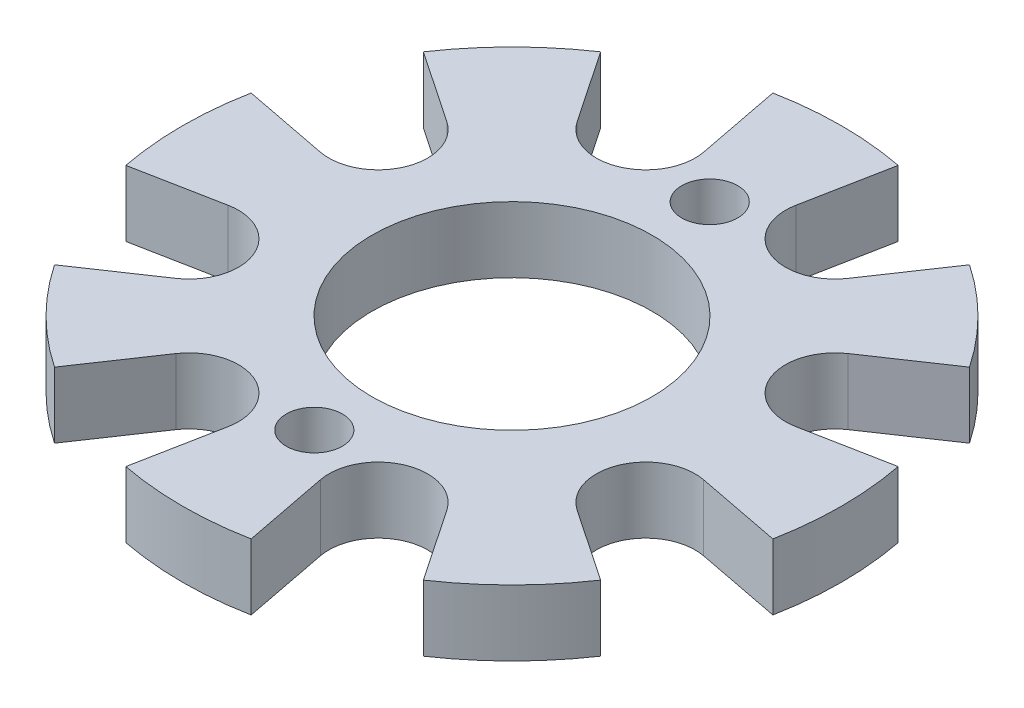
ISO-10303-21;
HEADER;
FILE_DESCRIPTION(('STEP AP214'),'2;1');
FILE_NAME('part.step','',(''),(''),'','','');
FILE_SCHEMA(('AUTOMOTIVE_DESIGN { 1 0 10303 214 1 1 1 1 }'));
ENDSEC;
DATA;
#1=APPLICATION_CONTEXT('core data for automotive mechanical design processes');
#2=APPLICATION_PROTOCOL_DEFINITION('international standard','automotive_design',2000,#1);
#3=PRODUCT_CONTEXT('',#1,'mechanical');
#4=PRODUCT('Part','Part','',(#3));
#5=PRODUCT_RELATED_PRODUCT_CATEGORY('part','',(#4));
#6=PRODUCT_DEFINITION_FORMATION('','',#4);
#7=PRODUCT_DEFINITION_CONTEXT('part definition',#1,'design');
#8=PRODUCT_DEFINITION('design','',#6,#7);
#9=PRODUCT_DEFINITION_SHAPE('','',#8);
#10=(LENGTH_UNIT() NAMED_UNIT(*) SI_UNIT(.MILLI.,.METRE.));
#11=(NAMED_UNIT(*) PLANE_ANGLE_UNIT() SI_UNIT($,.RADIAN.));
#12=(NAMED_UNIT(*) SI_UNIT($,.STERADIAN.) SOLID_ANGLE_UNIT());
#13=UNCERTAINTY_MEASURE_WITH_UNIT(LENGTH_MEASURE(1.E-05),#10,'distance_accuracy_value','');
#14=(GEOMETRIC_REPRESENTATION_CONTEXT(3) GLOBAL_UNCERTAINTY_ASSIGNED_CONTEXT((#13)) GLOBAL_UNIT_ASSIGNED_CONTEXT((#10,
#11,#12)) REPRESENTATION_CONTEXT('',''));
#15=CARTESIAN_POINT('',(0.,0.,0.));
#16=DIRECTION('',(0.,0.,1.));
#17=DIRECTION('',(1.,0.,0.));
#18=AXIS2_PLACEMENT_3D('',#15,#16,#17);
#19=CARTESIAN_POINT('',(0.,4.,0.));
#20=DIRECTION('',(0.,1.,0.));
#21=DIRECTION('',(0.,0.,1.));
#22=AXIS2_PLACEMENT_3D('',#19,#20,#21);
#23=PLANE('',#22);
#24=CARTESIAN_POINT('',(0.,4.,0.));
#25=DIRECTION('',(0.,1.,0.));
#26=DIRECTION('',(0.,0.,1.));
#27=AXIS2_PLACEMENT_3D('',#24,#25,#26);
#28=CIRCLE('',#27,8.5);
#29=CARTESIAN_POINT('',(0.,4.,8.5));
#30=VERTEX_POINT('',#29);
#31=EDGE_CURVE('E425',#30,#30,#28,.T.);
#32=ORIENTED_EDGE('',*,*,#31,.F.);
#33=EDGE_LOOP('',(#32));
#34=FACE_BOUND('',#33,.T.);
#35=CARTESIAN_POINT('',(0.,4.,-12.));
#36=DIRECTION('',(0.,1.,0.));
#37=DIRECTION('',(0.,0.,1.));
#38=AXIS2_PLACEMENT_3D('',#35,#36,#37);
#39=CIRCLE('',#38,1.7);
#40=CARTESIAN_POINT('',(0.,4.,-10.3));
#41=VERTEX_POINT('',#40);
#42=EDGE_CURVE('E280',#41,#41,#39,.T.);
#43=ORIENTED_EDGE('',*,*,#42,.F.);
#44=EDGE_LOOP('',(#43));
#45=FACE_BOUND('',#44,.T.);
#46=CARTESIAN_POINT('',(0.,4.,12.));
#47=DIRECTION('',(0.,1.,0.));
#48=DIRECTION('',(0.,0.,1.));
#49=AXIS2_PLACEMENT_3D('',#46,#47,#48);
#50=CIRCLE('',#49,1.7);
#51=CARTESIAN_POINT('',(0.,4.,13.7));
#52=VERTEX_POINT('',#51);
#53=EDGE_CURVE('E413',#52,#52,#50,.T.);
#54=ORIENTED_EDGE('',*,*,#53,.F.);
#55=EDGE_LOOP('',(#54));
#56=FACE_BOUND('',#55,.T.);
#57=CARTESIAN_POINT('',(13.8581929876692,4.,-5.7402514854765));
#58=DIRECTION('',(0.,1.,0.));
#59=DIRECTION('',(0.,0.,1.));
#60=AXIS2_PLACEMENT_3D('',#57,#58,#59);
#61=CIRCLE('',#60,3.);
#62=CARTESIAN_POINT('',(12.1790102973888,4.,-8.22628155220189));
#63=VERTEX_POINT('',#62);
#64=CARTESIAN_POINT('',(14.4287202389361,4.,-2.795001299913));
#65=VERTEX_POINT('',#64);
#66=EDGE_CURVE('E266',#63,#65,#61,.T.);
#67=ORIENTED_EDGE('',*,*,#66,.F.);
#68=DIRECTION('',(-0.828676688908462,0.,0.559727563426806));
#69=VECTOR('',#68,1.);
#70=CARTESIAN_POINT('',(0.,4.,0.));
#71=LINE('',#70,#69);
#72=CARTESIAN_POINT('',(16.5735337781692,4.,-11.1945512685361));
#73=VERTEX_POINT('',#72);
#74=EDGE_CURVE('E253',#73,#63,#71,.T.);
#75=ORIENTED_EDGE('',*,*,#74,.F.);
#76=CARTESIAN_POINT('',(0.,4.,0.));
#77=DIRECTION('',(0.,1.,0.));
#78=DIRECTION('',(0.,0.,1.));
#79=AXIS2_PLACEMENT_3D('',#76,#77,#78);
#80=CIRCLE('',#79,20.);
#81=CARTESIAN_POINT('',(11.1945512685359,4.,-16.5735337781694));
#82=VERTEX_POINT('',#81);
#83=EDGE_CURVE('E48',#73,#82,#80,.T.);
#84=ORIENTED_EDGE('',*,*,#83,.T.);
#85=DIRECTION('',(-0.559727563426797,0.,0.828676688908467));
#86=VECTOR('',#85,1.);
#87=CARTESIAN_POINT('',(0.,4.,0.));
#88=LINE('',#87,#86);
#89=CARTESIAN_POINT('',(8.22628155220176,4.,-12.1790102973889));
#90=VERTEX_POINT('',#89);
#91=EDGE_CURVE('E404',#82,#90,#88,.T.);
#92=ORIENTED_EDGE('',*,*,#91,.T.);
#93=CARTESIAN_POINT('',(5.74025148547636,4.,-13.8581929876693));
#94=DIRECTION('',(0.,1.,0.));
#95=DIRECTION('',(0.,0.,1.));
#96=AXIS2_PLACEMENT_3D('',#93,#94,#95);
#97=CIRCLE('',#96,3.);
#98=CARTESIAN_POINT('',(2.79500129991285,4.,-14.4287202389361));
#99=VERTEX_POINT('',#98);
#100=EDGE_CURVE('E394',#99,#90,#97,.T.);
#101=ORIENTED_EDGE('',*,*,#100,.F.);
#102=DIRECTION('',(-0.190175750422282,0.,0.981750061854504));
#103=VECTOR('',#102,1.);
#104=CARTESIAN_POINT('',(0.,4.,0.));
#105=LINE('',#104,#103);
#106=CARTESIAN_POINT('',(3.80351500844565,4.,-19.6350012370901));
#107=VERTEX_POINT('',#106);
#108=EDGE_CURVE('E399',#107,#99,#105,.T.);
#109=ORIENTED_EDGE('',*,*,#108,.F.);
#110=CARTESIAN_POINT('',(-3.80351500844565,4.,-19.6350012370901));
#111=VERTEX_POINT('',#110);
#112=EDGE_CURVE('E12',#107,#111,#80,.T.);
#113=ORIENTED_EDGE('',*,*,#112,.T.);
#114=DIRECTION('',(0.190175750422283,0.,0.981750061854504));
#115=VECTOR('',#114,1.);
#116=CARTESIAN_POINT('',(0.,4.,0.));
#117=LINE('',#116,#115);
#118=CARTESIAN_POINT('',(-2.79500129991285,4.,-14.4287202389361));
#119=VERTEX_POINT('',#118);
#120=EDGE_CURVE('E389',#111,#119,#117,.T.);
#121=ORIENTED_EDGE('',*,*,#120,.T.);
#122=CARTESIAN_POINT('',(-5.74025148547636,4.,-13.8581929876693));
#123=DIRECTION('',(0.,1.,0.));
#124=DIRECTION('',(0.,0.,1.));
#125=AXIS2_PLACEMENT_3D('',#122,#123,#124);
#126=CIRCLE('',#125,3.);
#127=CARTESIAN_POINT('',(-8.22628155220176,4.,-12.1790102973889));
#128=VERTEX_POINT('',#127);
#129=EDGE_CURVE('E379',#128,#119,#126,.T.);
#130=ORIENTED_EDGE('',*,*,#129,.F.);
#131=DIRECTION('',(0.559727563426797,0.,0.828676688908467));
#132=VECTOR('',#131,1.);
#133=CARTESIAN_POINT('',(0.,4.,0.));
#134=LINE('',#133,#132);
#135=CARTESIAN_POINT('',(-11.1945512685359,4.,-16.5735337781694));
#136=VERTEX_POINT('',#135);
#137=EDGE_CURVE('E384',#136,#128,#134,.T.);
#138=ORIENTED_EDGE('',*,*,#137,.F.);
#139=CARTESIAN_POINT('',(-16.5735337781694,4.,-11.1945512685359));
#140=VERTEX_POINT('',#139);
#141=EDGE_CURVE('E47',#136,#140,#80,.T.);
#142=ORIENTED_EDGE('',*,*,#141,.T.);
#143=DIRECTION('',(0.828676688908469,0.,0.559727563426794));
#144=VECTOR('',#143,1.);
#145=CARTESIAN_POINT('',(0.,4.,0.));
#146=LINE('',#145,#144);
#147=CARTESIAN_POINT('',(-12.1790102973889,4.,-8.22628155220171));
#148=VERTEX_POINT('',#147);
#149=EDGE_CURVE('E374',#140,#148,#146,.T.);
#150=ORIENTED_EDGE('',*,*,#149,.T.);
#151=CARTESIAN_POINT('',(-13.8581929876693,4.,-5.74025148547631));
#152=DIRECTION('',(0.,1.,0.));
#153=DIRECTION('',(0.,0.,1.));
#154=AXIS2_PLACEMENT_3D('',#151,#152,#153);
#155=CIRCLE('',#154,3.);
#156=CARTESIAN_POINT('',(-14.4287202389362,4.,-2.7950012999128));
#157=VERTEX_POINT('',#156);
#158=EDGE_CURVE('E364',#157,#148,#155,.T.);
#159=ORIENTED_EDGE('',*,*,#158,.F.);
#160=DIRECTION('',(0.981750061854504,0.,0.190175750422279));
#161=VECTOR('',#160,1.);
#162=CARTESIAN_POINT('',(0.,4.,0.));
#163=LINE('',#162,#161);
#164=CARTESIAN_POINT('',(-19.6350012370901,4.,-3.80351500844558));
#165=VERTEX_POINT('',#164);
#166=EDGE_CURVE('E369',#165,#157,#163,.T.);
#167=ORIENTED_EDGE('',*,*,#166,.F.);
#168=CARTESIAN_POINT('',(-19.6350012370901,4.,3.80351500844572));
#169=VERTEX_POINT('',#168);
#170=EDGE_CURVE('E664',#165,#169,#80,.T.);
#171=ORIENTED_EDGE('',*,*,#170,.T.);
#172=DIRECTION('',(0.981750061854503,0.,-0.190175750422286));
#173=VECTOR('',#172,1.);
#174=CARTESIAN_POINT('',(0.,4.,0.));
#175=LINE('',#174,#173);
#176=CARTESIAN_POINT('',(-14.4287202389361,4.,2.7950012999129));
#177=VERTEX_POINT('',#176);
#178=EDGE_CURVE('E359',#169,#177,#175,.T.);
#179=ORIENTED_EDGE('',*,*,#178,.T.);
#180=CARTESIAN_POINT('',(-13.8581929876693,4.,5.74025148547641));
#181=DIRECTION('',(0.,1.,0.));
#182=DIRECTION('',(0.,0.,1.));
#183=AXIS2_PLACEMENT_3D('',#180,#181,#182);
#184=CIRCLE('',#183,3.);
#185=CARTESIAN_POINT('',(-12.1790102973889,4.,8.2262815522018));
#186=VERTEX_POINT('',#185);
#187=EDGE_CURVE('E349',#186,#177,#184,.T.);
#188=ORIENTED_EDGE('',*,*,#187,.F.);
#189=DIRECTION('',(0.828676688908465,0.,-0.5597275634268));
#190=VECTOR('',#189,1.);
#191=CARTESIAN_POINT('',(0.,4.,0.));
#192=LINE('',#191,#190);
#193=CARTESIAN_POINT('',(-16.5735337781693,4.,11.194551268536));
#194=VERTEX_POINT('',#193);
#195=EDGE_CURVE('E354',#194,#186,#192,.T.);
#196=ORIENTED_EDGE('',*,*,#195,.F.);
#197=CARTESIAN_POINT('',(-11.1945512685359,4.,16.5735337781694));
#198=VERTEX_POINT('',#197);
#199=EDGE_CURVE('E666',#194,#198,#80,.T.);
#200=ORIENTED_EDGE('',*,*,#199,.T.);
#201=DIRECTION('',(0.559727563426797,0.,-0.828676688908467));
#202=VECTOR('',#201,1.);
#203=CARTESIAN_POINT('',(0.,4.,0.));
#204=LINE('',#203,#202);
#205=CARTESIAN_POINT('',(-8.22628155220176,4.,12.1790102973889));
#206=VERTEX_POINT('',#205);
#207=EDGE_CURVE('E344',#198,#206,#204,.T.);
#208=ORIENTED_EDGE('',*,*,#207,.T.);
#209=CARTESIAN_POINT('',(-5.74025148547636,4.,13.8581929876693));
#210=DIRECTION('',(0.,1.,0.));
#211=DIRECTION('',(0.,0.,1.));
#212=AXIS2_PLACEMENT_3D('',#209,#210,#211);
#213=CIRCLE('',#212,3.);
#214=CARTESIAN_POINT('',(-2.79500129991285,4.,14.4287202389361));
#215=VERTEX_POINT('',#214);
#216=EDGE_CURVE('E334',#215,#206,#213,.T.);
#217=ORIENTED_EDGE('',*,*,#216,.F.);
#218=DIRECTION('',(0.190175750422282,0.,-0.981750061854504));
#219=VECTOR('',#218,1.);
#220=CARTESIAN_POINT('',(0.,4.,0.));
#221=LINE('',#220,#219);
#222=CARTESIAN_POINT('',(-3.80351500844565,4.,19.6350012370901));
#223=VERTEX_POINT('',#222);
#224=EDGE_CURVE('E339',#223,#215,#221,.T.);
#225=ORIENTED_EDGE('',*,*,#224,.F.);
#226=CARTESIAN_POINT('',(3.80351500844579,4.,19.63500123709));
#227=VERTEX_POINT('',#226);
#228=EDGE_CURVE('E670',#223,#227,#80,.T.);
#229=ORIENTED_EDGE('',*,*,#228,.T.);
#230=DIRECTION('',(-0.190175750422289,0.,-0.981750061854502));
#231=VECTOR('',#230,1.);
#232=CARTESIAN_POINT('',(0.,4.,0.));
#233=LINE('',#232,#231);
#234=CARTESIAN_POINT('',(2.79500129991295,4.,14.4287202389361));
#235=VERTEX_POINT('',#234);
#236=EDGE_CURVE('E329',#227,#235,#233,.T.);
#237=ORIENTED_EDGE('',*,*,#236,.T.);
#238=CARTESIAN_POINT('',(5.74025148547645,4.,13.8581929876693));
#239=DIRECTION('',(0.,1.,0.));
#240=DIRECTION('',(0.,0.,1.));
#241=AXIS2_PLACEMENT_3D('',#238,#239,#240);
#242=CIRCLE('',#241,3.);
#243=CARTESIAN_POINT('',(8.22628155220184,4.,12.1790102973888));
#244=VERTEX_POINT('',#243);
#245=EDGE_CURVE('E321',#244,#235,#242,.T.);
#246=ORIENTED_EDGE('',*,*,#245,.F.);
#247=DIRECTION('',(-0.559727563426803,0.,-0.828676688908463));
#248=VECTOR('',#247,1.);
#249=CARTESIAN_POINT('',(0.,4.,0.));
#250=LINE('',#249,#248);
#251=CARTESIAN_POINT('',(11.1945512685361,4.,16.5735337781693));
#252=VERTEX_POINT('',#251);
#253=EDGE_CURVE('E325',#252,#244,#250,.T.);
#254=ORIENTED_EDGE('',*,*,#253,.F.);
#255=CARTESIAN_POINT('',(16.5735337781695,4.,11.1945512685358));
#256=VERTEX_POINT('',#255);
#257=EDGE_CURVE('E274',#252,#256,#80,.T.);
#258=ORIENTED_EDGE('',*,*,#257,.T.);
#259=DIRECTION('',(-0.828676688908473,0.,-0.559727563426788));
#260=VECTOR('',#259,1.);
#261=CARTESIAN_POINT('',(0.,4.,0.));
#262=LINE('',#261,#260);
#263=CARTESIAN_POINT('',(12.179010297389,4.,8.22628155220163));
#264=VERTEX_POINT('',#263);
#265=EDGE_CURVE('E63',#256,#264,#262,.T.);
#266=ORIENTED_EDGE('',*,*,#265,.T.);
#267=CARTESIAN_POINT('',(13.8581929876694,4.,5.74025148547621));
#268=DIRECTION('',(0.,1.,0.));
#269=DIRECTION('',(0.,0.,1.));
#270=AXIS2_PLACEMENT_3D('',#267,#268,#269);
#271=CIRCLE('',#270,3.);
#272=CARTESIAN_POINT('',(14.4287202389362,4.,2.7950012999127));
#273=VERTEX_POINT('',#272);
#274=EDGE_CURVE('E442',#273,#264,#271,.T.);
#275=ORIENTED_EDGE('',*,*,#274,.F.);
#276=DIRECTION('',(-0.981750061854506,0.,-0.190175750422272));
#277=VECTOR('',#276,1.);
#278=CARTESIAN_POINT('',(0.,4.,0.));
#279=LINE('',#278,#277);
#280=CARTESIAN_POINT('',(19.6350012370901,4.,3.80351500844544));
#281=VERTEX_POINT('',#280);
#282=EDGE_CURVE('E445',#281,#273,#279,.T.);
#283=ORIENTED_EDGE('',*,*,#282,.F.);
#284=CARTESIAN_POINT('',(19.63500123709,4.,-3.80351500844586));
#285=VERTEX_POINT('',#284);
#286=EDGE_CURVE('E272',#281,#285,#80,.T.);
#287=ORIENTED_EDGE('',*,*,#286,.T.);
#288=DIRECTION('',(-0.981750061854502,0.,0.190175750422293));
#289=VECTOR('',#288,1.);
#290=CARTESIAN_POINT('',(0.,4.,0.));
#291=LINE('',#290,#289);
#292=EDGE_CURVE('E55',#285,#65,#291,.T.);
#293=ORIENTED_EDGE('',*,*,#292,.T.);
#294=EDGE_LOOP('',(#67,#75,#84,#92,#101,#109,#113,#121,#130,#138,#142,#150,#159,#167,#171,#179,
#188,#196,#200,#208,#217,#225,#229,#237,#246,#254,#258,#266,#275,#283,#287,#293));
#295=FACE_BOUND('',#294,.T.);
#296=ADVANCED_FACE('F38',(#34,#45,#56,#295),#23,.T.);
#297=CARTESIAN_POINT('',(0.,0.,0.));
#298=DIRECTION('',(0.,1.,0.));
#299=DIRECTION('',(0.,0.,1.));
#300=AXIS2_PLACEMENT_3D('',#297,#298,#299);
#301=PLANE('',#300);
#302=CARTESIAN_POINT('',(0.,0.,0.));
#303=DIRECTION('',(0.,1.,0.));
#304=DIRECTION('',(0.,0.,1.));
#305=AXIS2_PLACEMENT_3D('',#302,#303,#304);
#306=CIRCLE('',#305,8.5);
#307=CARTESIAN_POINT('',(0.,0.,8.5));
#308=VERTEX_POINT('',#307);
#309=EDGE_CURVE('E424',#308,#308,#306,.T.);
#310=ORIENTED_EDGE('',*,*,#309,.T.);
#311=EDGE_LOOP('',(#310));
#312=FACE_BOUND('',#311,.T.);
#313=CARTESIAN_POINT('',(0.,0.,-12.));
#314=DIRECTION('',(0.,1.,0.));
#315=DIRECTION('',(0.,0.,1.));
#316=AXIS2_PLACEMENT_3D('',#313,#314,#315);
#317=CIRCLE('',#316,1.7);
#318=CARTESIAN_POINT('',(0.,0.,-10.3));
#319=VERTEX_POINT('',#318);
#320=EDGE_CURVE('E416',#319,#319,#317,.T.);
#321=ORIENTED_EDGE('',*,*,#320,.T.);
#322=EDGE_LOOP('',(#321));
#323=FACE_BOUND('',#322,.T.);
#324=CARTESIAN_POINT('',(0.,0.,12.));
#325=DIRECTION('',(0.,1.,0.));
#326=DIRECTION('',(0.,0.,-1.));
#327=AXIS2_PLACEMENT_3D('',#324,#325,#326);
#328=CIRCLE('',#327,1.7);
#329=CARTESIAN_POINT('',(0.,0.,10.3));
#330=VERTEX_POINT('',#329);
#331=EDGE_CURVE('E408',#330,#330,#328,.T.);
#332=ORIENTED_EDGE('',*,*,#331,.T.);
#333=EDGE_LOOP('',(#332));
#334=FACE_BOUND('',#333,.T.);
#335=DIRECTION('',(-0.828676688908462,0.,0.559727563426806));
#336=VECTOR('',#335,1.);
#337=CARTESIAN_POINT('',(0.,0.,0.));
#338=LINE('',#337,#336);
#339=CARTESIAN_POINT('',(16.5735337781692,0.,-11.1945512685361));
#340=VERTEX_POINT('',#339);
#341=CARTESIAN_POINT('',(12.1790102973888,0.,-8.22628155220189));
#342=VERTEX_POINT('',#341);
#343=EDGE_CURVE('E256',#340,#342,#338,.T.);
#344=ORIENTED_EDGE('',*,*,#343,.T.);
#345=CARTESIAN_POINT('',(13.8581929876692,0.,-5.7402514854765));
#346=DIRECTION('',(0.,1.,0.));
#347=DIRECTION('',(-0.707106781186539,0.,0.707106781186556));
#348=AXIS2_PLACEMENT_3D('',#345,#346,#347);
#349=CIRCLE('',#348,3.);
#350=CARTESIAN_POINT('',(14.4287202389361,0.,-2.795001299913));
#351=VERTEX_POINT('',#350);
#352=EDGE_CURVE('E430',#342,#351,#349,.T.);
#353=ORIENTED_EDGE('',*,*,#352,.T.);
#354=DIRECTION('',(-0.981750061854502,0.,0.190175750422293));
#355=VECTOR('',#354,1.);
#356=CARTESIAN_POINT('',(0.,0.,0.));
#357=LINE('',#356,#355);
#358=CARTESIAN_POINT('',(19.63500123709,0.,-3.80351500844586));
#359=VERTEX_POINT('',#358);
#360=EDGE_CURVE('E433',#359,#351,#357,.T.);
#361=ORIENTED_EDGE('',*,*,#360,.F.);
#362=CARTESIAN_POINT('',(0.,0.,0.));
#363=DIRECTION('',(0.,1.,0.));
#364=DIRECTION('',(0.,0.,1.));
#365=AXIS2_PLACEMENT_3D('',#362,#363,#364);
#366=CIRCLE('',#365,20.);
#367=CARTESIAN_POINT('',(19.6350012370901,0.,3.80351500844544));
#368=VERTEX_POINT('',#367);
#369=EDGE_CURVE('E470',#368,#359,#366,.T.);
#370=ORIENTED_EDGE('',*,*,#369,.F.);
#371=DIRECTION('',(-0.981750061854506,0.,-0.190175750422272));
#372=VECTOR('',#371,1.);
#373=CARTESIAN_POINT('',(0.,0.,0.));
#374=LINE('',#373,#372);
#375=CARTESIAN_POINT('',(14.4287202389362,0.,2.7950012999127));
#376=VERTEX_POINT('',#375);
#377=EDGE_CURVE('E448',#368,#376,#374,.T.);
#378=ORIENTED_EDGE('',*,*,#377,.T.);
#379=CARTESIAN_POINT('',(13.8581929876694,0.,5.74025148547621));
#380=DIRECTION('',(0.,1.,0.));
#381=DIRECTION('',(-1.,0.,0.));
#382=AXIS2_PLACEMENT_3D('',#379,#380,#381);
#383=CIRCLE('',#382,3.);
#384=CARTESIAN_POINT('',(12.179010297389,0.,8.22628155220163));
#385=VERTEX_POINT('',#384);
#386=EDGE_CURVE('E451',#376,#385,#383,.T.);
#387=ORIENTED_EDGE('',*,*,#386,.T.);
#388=DIRECTION('',(-0.828676688908473,0.,-0.559727563426788));
#389=VECTOR('',#388,1.);
#390=CARTESIAN_POINT('',(0.,0.,0.));
#391=LINE('',#390,#389);
#392=CARTESIAN_POINT('',(16.5735337781695,0.,11.1945512685358));
#393=VERTEX_POINT('',#392);
#394=EDGE_CURVE('E454',#393,#385,#391,.T.);
#395=ORIENTED_EDGE('',*,*,#394,.F.);
#396=CARTESIAN_POINT('',(11.1945512685361,0.,16.5735337781693));
#397=VERTEX_POINT('',#396);
#398=EDGE_CURVE('E475',#397,#393,#366,.T.);
#399=ORIENTED_EDGE('',*,*,#398,.F.);
#400=DIRECTION('',(-0.559727563426803,0.,-0.828676688908463));
#401=VECTOR('',#400,1.);
#402=CARTESIAN_POINT('',(0.,0.,0.));
#403=LINE('',#402,#401);
#404=CARTESIAN_POINT('',(8.22628155220184,0.,12.1790102973888));
#405=VERTEX_POINT('',#404);
#406=EDGE_CURVE('E688',#397,#405,#403,.T.);
#407=ORIENTED_EDGE('',*,*,#406,.T.);
#408=CARTESIAN_POINT('',(5.74025148547645,0.,13.8581929876693));
#409=DIRECTION('',(0.,1.,0.));
#410=DIRECTION('',(-0.707106781186554,0.,-0.707106781186541));
#411=AXIS2_PLACEMENT_3D('',#408,#409,#410);
#412=CIRCLE('',#411,3.);
#413=CARTESIAN_POINT('',(2.79500129991295,0.,14.4287202389361));
#414=VERTEX_POINT('',#413);
#415=EDGE_CURVE('E691',#405,#414,#412,.T.);
#416=ORIENTED_EDGE('',*,*,#415,.T.);
#417=DIRECTION('',(-0.190175750422289,0.,-0.981750061854502));
#418=VECTOR('',#417,1.);
#419=CARTESIAN_POINT('',(0.,0.,0.));
#420=LINE('',#419,#418);
#421=CARTESIAN_POINT('',(3.80351500844579,0.,19.6350012370901));
#422=VERTEX_POINT('',#421);
#423=EDGE_CURVE('E692',#422,#414,#420,.T.);
#424=ORIENTED_EDGE('',*,*,#423,.F.);
#425=CARTESIAN_POINT('',(-3.80351500844565,0.,19.6350012370901));
#426=VERTEX_POINT('',#425);
#427=EDGE_CURVE('E477',#426,#422,#366,.T.);
#428=ORIENTED_EDGE('',*,*,#427,.F.);
#429=DIRECTION('',(0.190175750422282,0.,-0.981750061854504));
#430=VECTOR('',#429,1.);
#431=CARTESIAN_POINT('',(0.,0.,0.));
#432=LINE('',#431,#430);
#433=CARTESIAN_POINT('',(-2.79500129991285,0.,14.4287202389361));
#434=VERTEX_POINT('',#433);
#435=EDGE_CURVE('E768',#426,#434,#432,.T.);
#436=ORIENTED_EDGE('',*,*,#435,.T.);
#437=CARTESIAN_POINT('',(-5.74025148547636,0.,13.8581929876693));
#438=DIRECTION('',(0.,1.,0.));
#439=DIRECTION('',(0.,0.,-1.));
#440=AXIS2_PLACEMENT_3D('',#437,#438,#439);
#441=CIRCLE('',#440,3.);
#442=CARTESIAN_POINT('',(-8.22628155220176,0.,12.1790102973889));
#443=VERTEX_POINT('',#442);
#444=EDGE_CURVE('E762',#434,#443,#441,.T.);
#445=ORIENTED_EDGE('',*,*,#444,.T.);
#446=DIRECTION('',(0.559727563426797,0.,-0.828676688908467));
#447=VECTOR('',#446,1.);
#448=CARTESIAN_POINT('',(0.,0.,0.));
#449=LINE('',#448,#447);
#450=CARTESIAN_POINT('',(-11.1945512685359,0.,16.5735337781694));
#451=VERTEX_POINT('',#450);
#452=EDGE_CURVE('E760',#451,#443,#449,.T.);
#453=ORIENTED_EDGE('',*,*,#452,.F.);
#454=CARTESIAN_POINT('',(-16.5735337781693,0.,11.194551268536));
#455=VERTEX_POINT('',#454);
#456=EDGE_CURVE('E710',#455,#451,#366,.T.);
#457=ORIENTED_EDGE('',*,*,#456,.F.);
#458=DIRECTION('',(0.828676688908465,0.,-0.5597275634268));
#459=VECTOR('',#458,1.);
#460=CARTESIAN_POINT('',(0.,0.,0.));
#461=LINE('',#460,#459);
#462=CARTESIAN_POINT('',(-12.1790102973889,0.,8.2262815522018));
#463=VERTEX_POINT('',#462);
#464=EDGE_CURVE('E751',#455,#463,#461,.T.);
#465=ORIENTED_EDGE('',*,*,#464,.T.);
#466=CARTESIAN_POINT('',(-13.8581929876693,0.,5.74025148547641));
#467=DIRECTION('',(0.,1.,0.));
#468=DIRECTION('',(0.707106781186544,0.,-0.707106781186551));
#469=AXIS2_PLACEMENT_3D('',#466,#467,#468);
#470=CIRCLE('',#469,3.);
#471=CARTESIAN_POINT('',(-14.4287202389361,0.,2.7950012999129));
#472=VERTEX_POINT('',#471);
#473=EDGE_CURVE('E745',#463,#472,#470,.T.);
#474=ORIENTED_EDGE('',*,*,#473,.T.);
#475=DIRECTION('',(0.981750061854503,0.,-0.190175750422286));
#476=VECTOR('',#475,1.);
#477=CARTESIAN_POINT('',(0.,0.,0.));
#478=LINE('',#477,#476);
#479=CARTESIAN_POINT('',(-19.6350012370901,0.,3.80351500844573));
#480=VERTEX_POINT('',#479);
#481=EDGE_CURVE('E742',#480,#472,#478,.T.);
#482=ORIENTED_EDGE('',*,*,#481,.F.);
#483=CARTESIAN_POINT('',(-19.6350012370901,0.,-3.80351500844558));
#484=VERTEX_POINT('',#483);
#485=EDGE_CURVE('E712',#484,#480,#366,.T.);
#486=ORIENTED_EDGE('',*,*,#485,.F.);
#487=DIRECTION('',(0.981750061854504,0.,0.190175750422279));
#488=VECTOR('',#487,1.);
#489=CARTESIAN_POINT('',(0.,0.,0.));
#490=LINE('',#489,#488);
#491=CARTESIAN_POINT('',(-14.4287202389362,0.,-2.7950012999128));
#492=VERTEX_POINT('',#491);
#493=EDGE_CURVE('E733',#484,#492,#490,.T.);
#494=ORIENTED_EDGE('',*,*,#493,.T.);
#495=CARTESIAN_POINT('',(-13.8581929876693,0.,-5.74025148547631));
#496=DIRECTION('',(0.,1.,0.));
#497=DIRECTION('',(1.,0.,0.));
#498=AXIS2_PLACEMENT_3D('',#495,#496,#497);
#499=CIRCLE('',#498,3.);
#500=CARTESIAN_POINT('',(-12.1790102973889,0.,-8.22628155220171));
#501=VERTEX_POINT('',#500);
#502=EDGE_CURVE('E728',#492,#501,#499,.T.);
#503=ORIENTED_EDGE('',*,*,#502,.T.);
#504=DIRECTION('',(0.828676688908469,0.,0.559727563426794));
#505=VECTOR('',#504,1.);
#506=CARTESIAN_POINT('',(0.,0.,0.));
#507=LINE('',#506,#505);
#508=CARTESIAN_POINT('',(-16.5735337781694,0.,-11.1945512685359));
#509=VERTEX_POINT('',#508);
#510=EDGE_CURVE('E725',#509,#501,#507,.T.);
#511=ORIENTED_EDGE('',*,*,#510,.F.);
#512=CARTESIAN_POINT('',(-11.1945512685359,0.,-16.5735337781693));
#513=VERTEX_POINT('',#512);
#514=EDGE_CURVE('E276',#513,#509,#366,.T.);
#515=ORIENTED_EDGE('',*,*,#514,.F.);
#516=DIRECTION('',(0.559727563426797,0.,0.828676688908467));
#517=VECTOR('',#516,1.);
#518=CARTESIAN_POINT('',(0.,0.,0.));
#519=LINE('',#518,#517);
#520=CARTESIAN_POINT('',(-8.22628155220176,0.,-12.1790102973889));
#521=VERTEX_POINT('',#520);
#522=EDGE_CURVE('E653',#513,#521,#519,.T.);
#523=ORIENTED_EDGE('',*,*,#522,.T.);
#524=CARTESIAN_POINT('',(-5.74025148547636,0.,-13.8581929876693));
#525=DIRECTION('',(0.,1.,0.));
#526=DIRECTION('',(0.707106781186549,0.,0.707106781186546));
#527=AXIS2_PLACEMENT_3D('',#524,#525,#526);
#528=CIRCLE('',#527,3.);
#529=CARTESIAN_POINT('',(-2.79500129991285,0.,-14.4287202389361));
#530=VERTEX_POINT('',#529);
#531=EDGE_CURVE('E652',#521,#530,#528,.T.);
#532=ORIENTED_EDGE('',*,*,#531,.T.);
#533=DIRECTION('',(0.190175750422283,0.,0.981750061854504));
#534=VECTOR('',#533,1.);
#535=CARTESIAN_POINT('',(0.,0.,0.));
#536=LINE('',#535,#534);
#537=CARTESIAN_POINT('',(-3.80351500844566,0.,-19.6350012370901));
#538=VERTEX_POINT('',#537);
#539=EDGE_CURVE('E644',#538,#530,#536,.T.);
#540=ORIENTED_EDGE('',*,*,#539,.F.);
#541=CARTESIAN_POINT('',(3.80351500844565,0.,-19.6350012370901));
#542=VERTEX_POINT('',#541);
#543=EDGE_CURVE('E42',#542,#538,#366,.T.);
#544=ORIENTED_EDGE('',*,*,#543,.F.);
#545=DIRECTION('',(-0.190175750422282,0.,0.981750061854504));
#546=VECTOR('',#545,1.);
#547=CARTESIAN_POINT('',(0.,0.,0.));
#548=LINE('',#547,#546);
#549=CARTESIAN_POINT('',(2.79500129991285,0.,-14.4287202389361));
#550=VERTEX_POINT('',#549);
#551=EDGE_CURVE('E622',#542,#550,#548,.T.);
#552=ORIENTED_EDGE('',*,*,#551,.T.);
#553=CARTESIAN_POINT('',(5.74025148547636,0.,-13.8581929876693));
#554=DIRECTION('',(0.,1.,0.));
#555=DIRECTION('',(0.,0.,1.));
#556=AXIS2_PLACEMENT_3D('',#553,#554,#555);
#557=CIRCLE('',#556,3.);
#558=CARTESIAN_POINT('',(8.22628155220176,0.,-12.1790102973889));
#559=VERTEX_POINT('',#558);
#560=EDGE_CURVE('E625',#550,#559,#557,.T.);
#561=ORIENTED_EDGE('',*,*,#560,.T.);
#562=DIRECTION('',(-0.559727563426797,0.,0.828676688908467));
#563=VECTOR('',#562,1.);
#564=CARTESIAN_POINT('',(0.,0.,0.));
#565=LINE('',#564,#563);
#566=CARTESIAN_POINT('',(11.1945512685359,0.,-16.5735337781694));
#567=VERTEX_POINT('',#566);
#568=EDGE_CURVE('E630',#567,#559,#565,.T.);
#569=ORIENTED_EDGE('',*,*,#568,.F.);
#570=EDGE_CURVE('E277',#340,#567,#366,.T.);
#571=ORIENTED_EDGE('',*,*,#570,.F.);
#572=EDGE_LOOP('',(#344,#353,#361,#370,#378,#387,#395,#399,#407,#416,#424,#428,#436,#445,#453,
#457,#465,#474,#482,#486,#494,#503,#511,#515,#523,#532,#540,#544,#552,#561,#569,#571));
#573=FACE_BOUND('',#572,.T.);
#574=ADVANCED_FACE('F474',(#312,#323,#334,#573),#301,.F.);
#575=CARTESIAN_POINT('',(0.,4.,0.));
#576=DIRECTION('',(0.,-1.,0.));
#577=DIRECTION('',(0.,0.,-1.));
#578=AXIS2_PLACEMENT_3D('',#575,#576,#577);
#579=CYLINDRICAL_SURFACE('',#578,20.);
#580=DIRECTION('',(0.,-1.,0.));
#581=VECTOR('',#580,1.);
#582=CARTESIAN_POINT('',(16.5735337781692,4.001,-11.1945512685361));
#583=LINE('',#582,#581);
#584=EDGE_CURVE('E250',#73,#340,#583,.T.);
#585=ORIENTED_EDGE('',*,*,#584,.T.);
#586=ORIENTED_EDGE('',*,*,#570,.T.);
#587=DIRECTION('',(0.,-1.,0.));
#588=VECTOR('',#587,1.);
#589=CARTESIAN_POINT('',(11.1945512685359,4.001,-16.5735337781694));
#590=LINE('',#589,#588);
#591=EDGE_CURVE('E271',#82,#567,#590,.T.);
#592=ORIENTED_EDGE('',*,*,#591,.F.);
#593=ORIENTED_EDGE('',*,*,#83,.F.);
#594=EDGE_LOOP('',(#585,#586,#592,#593));
#595=FACE_BOUND('',#594,.T.);
#596=ADVANCED_FACE('F269',(#595),#579,.T.);
#597=ORIENTED_EDGE('',*,*,#369,.T.);
#598=DIRECTION('',(0.,-1.,0.));
#599=VECTOR('',#598,1.);
#600=CARTESIAN_POINT('',(19.63500123709,4.001,-3.80351500844586));
#601=LINE('',#600,#599);
#602=EDGE_CURVE('E436',#285,#359,#601,.T.);
#603=ORIENTED_EDGE('',*,*,#602,.F.);
#604=ORIENTED_EDGE('',*,*,#286,.F.);
#605=DIRECTION('',(0.,-1.,0.));
#606=VECTOR('',#605,1.);
#607=CARTESIAN_POINT('',(19.6350012370901,4.001,3.80351500844544));
#608=LINE('',#607,#606);
#609=EDGE_CURVE('E322',#281,#368,#608,.T.);
#610=ORIENTED_EDGE('',*,*,#609,.T.);
#611=EDGE_LOOP('',(#597,#603,#604,#610));
#612=FACE_BOUND('',#611,.T.);
#613=ADVANCED_FACE('F469',(#612),#579,.T.);
#614=ORIENTED_EDGE('',*,*,#398,.T.);
#615=DIRECTION('',(0.,-1.,0.));
#616=VECTOR('',#615,1.);
#617=CARTESIAN_POINT('',(16.5735337781695,4.001,11.1945512685358));
#618=LINE('',#617,#616);
#619=EDGE_CURVE('E457',#256,#393,#618,.T.);
#620=ORIENTED_EDGE('',*,*,#619,.F.);
#621=ORIENTED_EDGE('',*,*,#257,.F.);
#622=DIRECTION('',(0.,-1.,0.));
#623=VECTOR('',#622,1.);
#624=CARTESIAN_POINT('',(11.1945512685361,4.001,16.5735337781693));
#625=LINE('',#624,#623);
#626=EDGE_CURVE('E335',#252,#397,#625,.T.);
#627=ORIENTED_EDGE('',*,*,#626,.T.);
#628=EDGE_LOOP('',(#614,#620,#621,#627));
#629=FACE_BOUND('',#628,.T.);
#630=ADVANCED_FACE('F683',(#629),#579,.T.);
#631=ORIENTED_EDGE('',*,*,#427,.T.);
#632=DIRECTION('',(0.,-1.,0.));
#633=VECTOR('',#632,1.);
#634=CARTESIAN_POINT('',(3.80351500844579,4.001,19.6350012370901));
#635=LINE('',#634,#633);
#636=EDGE_CURVE('E697',#227,#422,#635,.T.);
#637=ORIENTED_EDGE('',*,*,#636,.F.);
#638=ORIENTED_EDGE('',*,*,#228,.F.);
#639=DIRECTION('',(0.,-1.,0.));
#640=VECTOR('',#639,1.);
#641=CARTESIAN_POINT('',(-3.80351500844565,4.001,19.6350012370901));
#642=LINE('',#641,#640);
#643=EDGE_CURVE('E350',#223,#426,#642,.T.);
#644=ORIENTED_EDGE('',*,*,#643,.T.);
#645=EDGE_LOOP('',(#631,#637,#638,#644));
#646=FACE_BOUND('',#645,.T.);
#647=ADVANCED_FACE('F709',(#646),#579,.T.);
#648=ORIENTED_EDGE('',*,*,#456,.T.);
#649=DIRECTION('',(0.,-1.,0.));
#650=VECTOR('',#649,1.);
#651=CARTESIAN_POINT('',(-11.1945512685359,4.001,16.5735337781694));
#652=LINE('',#651,#650);
#653=EDGE_CURVE('E764',#198,#451,#652,.T.);
#654=ORIENTED_EDGE('',*,*,#653,.F.);
#655=ORIENTED_EDGE('',*,*,#199,.F.);
#656=DIRECTION('',(0.,-1.,0.));
#657=VECTOR('',#656,1.);
#658=CARTESIAN_POINT('',(-16.5735337781693,4.001,11.194551268536));
#659=LINE('',#658,#657);
#660=EDGE_CURVE('E365',#194,#455,#659,.T.);
#661=ORIENTED_EDGE('',*,*,#660,.T.);
#662=EDGE_LOOP('',(#648,#654,#655,#661));
#663=FACE_BOUND('',#662,.T.);
#664=ADVANCED_FACE('F756',(#663),#579,.T.);
#665=ORIENTED_EDGE('',*,*,#485,.T.);
#666=DIRECTION('',(0.,-1.,0.));
#667=VECTOR('',#666,1.);
#668=CARTESIAN_POINT('',(-19.6350012370901,4.001,3.80351500844573));
#669=LINE('',#668,#667);
#670=EDGE_CURVE('E747',#169,#480,#669,.T.);
#671=ORIENTED_EDGE('',*,*,#670,.F.);
#672=ORIENTED_EDGE('',*,*,#170,.F.);
#673=DIRECTION('',(0.,-1.,0.));
#674=VECTOR('',#673,1.);
#675=CARTESIAN_POINT('',(-19.6350012370901,4.001,-3.80351500844558));
#676=LINE('',#675,#674);
#677=EDGE_CURVE('E380',#165,#484,#676,.T.);
#678=ORIENTED_EDGE('',*,*,#677,.T.);
#679=EDGE_LOOP('',(#665,#671,#672,#678));
#680=FACE_BOUND('',#679,.T.);
#681=ADVANCED_FACE('F738',(#680),#579,.T.);
#682=ORIENTED_EDGE('',*,*,#514,.T.);
#683=DIRECTION('',(0.,-1.,0.));
#684=VECTOR('',#683,1.);
#685=CARTESIAN_POINT('',(-16.5735337781694,4.001,-11.1945512685359));
#686=LINE('',#685,#684);
#687=EDGE_CURVE('E663',#140,#509,#686,.T.);
#688=ORIENTED_EDGE('',*,*,#687,.F.);
#689=ORIENTED_EDGE('',*,*,#141,.F.);
#690=DIRECTION('',(0.,-1.,0.));
#691=VECTOR('',#690,1.);
#692=CARTESIAN_POINT('',(-11.1945512685359,4.001,-16.5735337781693));
#693=LINE('',#692,#691);
#694=EDGE_CURVE('E395',#136,#513,#693,.T.);
#695=ORIENTED_EDGE('',*,*,#694,.T.);
#696=EDGE_LOOP('',(#682,#688,#689,#695));
#697=FACE_BOUND('',#696,.T.);
#698=ADVANCED_FACE('F497',(#697),#579,.T.);
#699=ORIENTED_EDGE('',*,*,#543,.T.);
#700=DIRECTION('',(0.,-1.,0.));
#701=VECTOR('',#700,1.);
#702=CARTESIAN_POINT('',(-3.80351500844566,4.001,-19.6350012370901));
#703=LINE('',#702,#701);
#704=EDGE_CURVE('E638',#111,#538,#703,.T.);
#705=ORIENTED_EDGE('',*,*,#704,.F.);
#706=ORIENTED_EDGE('',*,*,#112,.F.);
#707=DIRECTION('',(0.,-1.,0.));
#708=VECTOR('',#707,1.);
#709=CARTESIAN_POINT('',(3.80351500844565,4.001,-19.6350012370901));
#710=LINE('',#709,#708);
#711=EDGE_CURVE('E409',#107,#542,#710,.T.);
#712=ORIENTED_EDGE('',*,*,#711,.T.);
#713=EDGE_LOOP('',(#699,#705,#706,#712));
#714=FACE_BOUND('',#713,.T.);
#715=ADVANCED_FACE('F40',(#714),#579,.T.);
#716=CARTESIAN_POINT('',(0.,4.001,-12.));
#717=DIRECTION('',(0.,-1.,0.));
#718=DIRECTION('',(0.,0.,-1.));
#719=AXIS2_PLACEMENT_3D('',#716,#717,#718);
#720=CYLINDRICAL_SURFACE('',#719,1.7);
#721=ORIENTED_EDGE('',*,*,#42,.T.);
#722=EDGE_LOOP('',(#721));
#723=FACE_BOUND('',#722,.T.);
#724=ORIENTED_EDGE('',*,*,#320,.F.);
#725=EDGE_LOOP('',(#724));
#726=FACE_BOUND('',#725,.T.);
#727=ADVANCED_FACE('F486',(#723,#726),#720,.F.);
#728=CARTESIAN_POINT('',(0.,4.001,12.));
#729=DIRECTION('',(0.,-1.,0.));
#730=DIRECTION('',(0.,0.,-1.));
#731=AXIS2_PLACEMENT_3D('',#728,#729,#730);
#732=CYLINDRICAL_SURFACE('',#731,1.7);
#733=ORIENTED_EDGE('',*,*,#53,.T.);
#734=EDGE_LOOP('',(#733));
#735=FACE_BOUND('',#734,.T.);
#736=ORIENTED_EDGE('',*,*,#331,.F.);
#737=EDGE_LOOP('',(#736));
#738=FACE_BOUND('',#737,.T.);
#739=ADVANCED_FACE('F488',(#735,#738),#732,.F.);
#740=CARTESIAN_POINT('',(0.,4.001,0.));
#741=DIRECTION('',(0.981750061854504,0.,0.190175750422282));
#742=DIRECTION('',(0.190175750422282,0.,-0.981750061854504));
#743=AXIS2_PLACEMENT_3D('',#740,#741,#742);
#744=PLANE('',#743);
#745=ORIENTED_EDGE('',*,*,#108,.T.);
#746=DIRECTION('',(0.,-1.,0.));
#747=VECTOR('',#746,1.);
#748=CARTESIAN_POINT('',(2.79500129991285,4.001,-14.4287202389361));
#749=LINE('',#748,#747);
#750=EDGE_CURVE('E617',#99,#550,#749,.T.);
#751=ORIENTED_EDGE('',*,*,#750,.T.);
#752=ORIENTED_EDGE('',*,*,#551,.F.);
#753=ORIENTED_EDGE('',*,*,#711,.F.);
#754=EDGE_LOOP('',(#745,#751,#752,#753));
#755=FACE_BOUND('',#754,.T.);
#756=ADVANCED_FACE('F494',(#755),#744,.T.);
#757=CARTESIAN_POINT('',(5.74025148547636,4.001,-13.8581929876693));
#758=DIRECTION('',(0.,-1.,0.));
#759=DIRECTION('',(0.,0.,-1.));
#760=AXIS2_PLACEMENT_3D('',#757,#758,#759);
#761=CYLINDRICAL_SURFACE('',#760,3.);
#762=ORIENTED_EDGE('',*,*,#100,.T.);
#763=DIRECTION('',(0.,-1.,0.));
#764=VECTOR('',#763,1.);
#765=CARTESIAN_POINT('',(8.22628155220176,4.001,-12.1790102973889));
#766=LINE('',#765,#764);
#767=EDGE_CURVE('E627',#90,#559,#766,.T.);
#768=ORIENTED_EDGE('',*,*,#767,.T.);
#769=ORIENTED_EDGE('',*,*,#560,.F.);
#770=ORIENTED_EDGE('',*,*,#750,.F.);
#771=EDGE_LOOP('',(#762,#768,#769,#770));
#772=FACE_BOUND('',#771,.T.);
#773=ADVANCED_FACE('F606',(#772),#761,.F.);
#774=CARTESIAN_POINT('',(0.,4.001,0.));
#775=DIRECTION('',(0.828676688908467,0.,0.559727563426797));
#776=DIRECTION('',(0.559727563426797,0.,-0.828676688908467));
#777=AXIS2_PLACEMENT_3D('',#774,#775,#776);
#778=PLANE('',#777);
#779=ORIENTED_EDGE('',*,*,#591,.T.);
#780=ORIENTED_EDGE('',*,*,#568,.T.);
#781=ORIENTED_EDGE('',*,*,#767,.F.);
#782=ORIENTED_EDGE('',*,*,#91,.F.);
#783=EDGE_LOOP('',(#779,#780,#781,#782));
#784=FACE_BOUND('',#783,.T.);
#785=ADVANCED_FACE('F602',(#784),#778,.F.);
#786=CARTESIAN_POINT('',(0.,4.001,0.));
#787=DIRECTION('',(0.828676688908467,0.,-0.559727563426797));
#788=DIRECTION('',(-0.559727563426797,0.,-0.828676688908467));
#789=AXIS2_PLACEMENT_3D('',#786,#787,#788);
#790=PLANE('',#789);
#791=ORIENTED_EDGE('',*,*,#137,.T.);
#792=DIRECTION('',(0.,-1.,0.));
#793=VECTOR('',#792,1.);
#794=CARTESIAN_POINT('',(-8.22628155220176,4.001,-12.1790102973889));
#795=LINE('',#794,#793);
#796=EDGE_CURVE('E647',#128,#521,#795,.T.);
#797=ORIENTED_EDGE('',*,*,#796,.T.);
#798=ORIENTED_EDGE('',*,*,#522,.F.);
#799=ORIENTED_EDGE('',*,*,#694,.F.);
#800=EDGE_LOOP('',(#791,#797,#798,#799));
#801=FACE_BOUND('',#800,.T.);
#802=ADVANCED_FACE('F598',(#801),#790,.T.);
#803=CARTESIAN_POINT('',(-5.74025148547636,4.001,-13.8581929876693));
#804=DIRECTION('',(0.,-1.,0.));
#805=DIRECTION('',(0.,0.,-1.));
#806=AXIS2_PLACEMENT_3D('',#803,#804,#805);
#807=CYLINDRICAL_SURFACE('',#806,3.);
#808=ORIENTED_EDGE('',*,*,#129,.T.);
#809=DIRECTION('',(0.,-1.,0.));
#810=VECTOR('',#809,1.);
#811=CARTESIAN_POINT('',(-2.79500129991285,4.001,-14.4287202389361));
#812=LINE('',#811,#810);
#813=EDGE_CURVE('E643',#119,#530,#812,.T.);
#814=ORIENTED_EDGE('',*,*,#813,.T.);
#815=ORIENTED_EDGE('',*,*,#531,.F.);
#816=ORIENTED_EDGE('',*,*,#796,.F.);
#817=EDGE_LOOP('',(#808,#814,#815,#816));
#818=FACE_BOUND('',#817,.T.);
#819=ADVANCED_FACE('F594',(#818),#807,.F.);
#820=CARTESIAN_POINT('',(0.,4.001,0.));
#821=DIRECTION('',(0.981750061854504,0.,-0.190175750422283));
#822=DIRECTION('',(-0.190175750422283,0.,-0.981750061854504));
#823=AXIS2_PLACEMENT_3D('',#820,#821,#822);
#824=PLANE('',#823);
#825=ORIENTED_EDGE('',*,*,#704,.T.);
#826=ORIENTED_EDGE('',*,*,#539,.T.);
#827=ORIENTED_EDGE('',*,*,#813,.F.);
#828=ORIENTED_EDGE('',*,*,#120,.F.);
#829=EDGE_LOOP('',(#825,#826,#827,#828));
#830=FACE_BOUND('',#829,.T.);
#831=ADVANCED_FACE('F590',(#830),#824,.F.);
#832=CARTESIAN_POINT('',(0.,4.001,0.));
#833=DIRECTION('',(0.190175750422279,0.,-0.981750061854504));
#834=DIRECTION('',(-0.981750061854504,0.,-0.190175750422279));
#835=AXIS2_PLACEMENT_3D('',#832,#833,#834);
#836=PLANE('',#835);
#837=ORIENTED_EDGE('',*,*,#166,.T.);
#838=DIRECTION('',(0.,-1.,0.));
#839=VECTOR('',#838,1.);
#840=CARTESIAN_POINT('',(-14.4287202389362,4.001,-2.7950012999128));
#841=LINE('',#840,#839);
#842=EDGE_CURVE('E736',#157,#492,#841,.T.);
#843=ORIENTED_EDGE('',*,*,#842,.T.);
#844=ORIENTED_EDGE('',*,*,#493,.F.);
#845=ORIENTED_EDGE('',*,*,#677,.F.);
#846=EDGE_LOOP('',(#837,#843,#844,#845));
#847=FACE_BOUND('',#846,.T.);
#848=ADVANCED_FACE('F586',(#847),#836,.T.);
#849=CARTESIAN_POINT('',(-13.8581929876693,4.001,-5.74025148547631));
#850=DIRECTION('',(0.,-1.,0.));
#851=DIRECTION('',(0.,0.,-1.));
#852=AXIS2_PLACEMENT_3D('',#849,#850,#851);
#853=CYLINDRICAL_SURFACE('',#852,3.);
#854=ORIENTED_EDGE('',*,*,#158,.T.);
#855=DIRECTION('',(0.,-1.,0.));
#856=VECTOR('',#855,1.);
#857=CARTESIAN_POINT('',(-12.1790102973889,4.001,-8.22628155220171));
#858=LINE('',#857,#856);
#859=EDGE_CURVE('E731',#148,#501,#858,.T.);
#860=ORIENTED_EDGE('',*,*,#859,.T.);
#861=ORIENTED_EDGE('',*,*,#502,.F.);
#862=ORIENTED_EDGE('',*,*,#842,.F.);
#863=EDGE_LOOP('',(#854,#860,#861,#862));
#864=FACE_BOUND('',#863,.T.);
#865=ADVANCED_FACE('F582',(#864),#853,.F.);
#866=CARTESIAN_POINT('',(0.,4.001,0.));
#867=DIRECTION('',(0.559727563426794,0.,-0.828676688908469));
#868=DIRECTION('',(-0.828676688908469,0.,-0.559727563426794));
#869=AXIS2_PLACEMENT_3D('',#866,#867,#868);
#870=PLANE('',#869);
#871=ORIENTED_EDGE('',*,*,#687,.T.);
#872=ORIENTED_EDGE('',*,*,#510,.T.);
#873=ORIENTED_EDGE('',*,*,#859,.F.);
#874=ORIENTED_EDGE('',*,*,#149,.F.);
#875=EDGE_LOOP('',(#871,#872,#873,#874));
#876=FACE_BOUND('',#875,.T.);
#877=ADVANCED_FACE('F578',(#876),#870,.F.);
#878=CARTESIAN_POINT('',(0.,4.001,0.));
#879=DIRECTION('',(-0.5597275634268,0.,-0.828676688908465));
#880=DIRECTION('',(-0.828676688908465,0.,0.5597275634268));
#881=AXIS2_PLACEMENT_3D('',#878,#879,#880);
#882=PLANE('',#881);
#883=ORIENTED_EDGE('',*,*,#195,.T.);
#884=DIRECTION('',(0.,-1.,0.));
#885=VECTOR('',#884,1.);
#886=CARTESIAN_POINT('',(-12.1790102973889,4.001,8.2262815522018));
#887=LINE('',#886,#885);
#888=EDGE_CURVE('E754',#186,#463,#887,.T.);
#889=ORIENTED_EDGE('',*,*,#888,.T.);
#890=ORIENTED_EDGE('',*,*,#464,.F.);
#891=ORIENTED_EDGE('',*,*,#660,.F.);
#892=EDGE_LOOP('',(#883,#889,#890,#891));
#893=FACE_BOUND('',#892,.T.);
#894=ADVANCED_FACE('F574',(#893),#882,.T.);
#895=CARTESIAN_POINT('',(-13.8581929876693,4.001,5.74025148547641));
#896=DIRECTION('',(0.,-1.,0.));
#897=DIRECTION('',(0.,0.,-1.));
#898=AXIS2_PLACEMENT_3D('',#895,#896,#897);
#899=CYLINDRICAL_SURFACE('',#898,3.);
#900=ORIENTED_EDGE('',*,*,#187,.T.);
#901=DIRECTION('',(0.,-1.,0.));
#902=VECTOR('',#901,1.);
#903=CARTESIAN_POINT('',(-14.4287202389361,4.001,2.7950012999129));
#904=LINE('',#903,#902);
#905=EDGE_CURVE('E749',#177,#472,#904,.T.);
#906=ORIENTED_EDGE('',*,*,#905,.T.);
#907=ORIENTED_EDGE('',*,*,#473,.F.);
#908=ORIENTED_EDGE('',*,*,#888,.F.);
#909=EDGE_LOOP('',(#900,#906,#907,#908));
#910=FACE_BOUND('',#909,.T.);
#911=ADVANCED_FACE('F570',(#910),#899,.F.);
#912=CARTESIAN_POINT('',(0.,4.001,0.));
#913=DIRECTION('',(-0.190175750422286,0.,-0.981750061854503));
#914=DIRECTION('',(-0.981750061854503,0.,0.190175750422286));
#915=AXIS2_PLACEMENT_3D('',#912,#913,#914);
#916=PLANE('',#915);
#917=ORIENTED_EDGE('',*,*,#670,.T.);
#918=ORIENTED_EDGE('',*,*,#481,.T.);
#919=ORIENTED_EDGE('',*,*,#905,.F.);
#920=ORIENTED_EDGE('',*,*,#178,.F.);
#921=EDGE_LOOP('',(#917,#918,#919,#920));
#922=FACE_BOUND('',#921,.T.);
#923=ADVANCED_FACE('F566',(#922),#916,.F.);
#924=CARTESIAN_POINT('',(0.,4.001,0.));
#925=DIRECTION('',(-0.981750061854504,0.,-0.190175750422282));
#926=DIRECTION('',(-0.190175750422282,0.,0.981750061854504));
#927=AXIS2_PLACEMENT_3D('',#924,#925,#926);
#928=PLANE('',#927);
#929=ORIENTED_EDGE('',*,*,#224,.T.);
#930=DIRECTION('',(0.,-1.,0.));
#931=VECTOR('',#930,1.);
#932=CARTESIAN_POINT('',(-2.79500129991285,4.001,14.4287202389361));
#933=LINE('',#932,#931);
#934=EDGE_CURVE('E771',#215,#434,#933,.T.);
#935=ORIENTED_EDGE('',*,*,#934,.T.);
#936=ORIENTED_EDGE('',*,*,#435,.F.);
#937=ORIENTED_EDGE('',*,*,#643,.F.);
#938=EDGE_LOOP('',(#929,#935,#936,#937));
#939=FACE_BOUND('',#938,.T.);
#940=ADVANCED_FACE('F562',(#939),#928,.T.);
#941=CARTESIAN_POINT('',(-5.74025148547636,4.001,13.8581929876693));
#942=DIRECTION('',(0.,-1.,0.));
#943=DIRECTION('',(0.,0.,-1.));
#944=AXIS2_PLACEMENT_3D('',#941,#942,#943);
#945=CYLINDRICAL_SURFACE('',#944,3.);
#946=ORIENTED_EDGE('',*,*,#216,.T.);
#947=DIRECTION('',(0.,-1.,0.));
#948=VECTOR('',#947,1.);
#949=CARTESIAN_POINT('',(-8.22628155220176,4.001,12.1790102973889));
#950=LINE('',#949,#948);
#951=EDGE_CURVE('E766',#206,#443,#950,.T.);
#952=ORIENTED_EDGE('',*,*,#951,.T.);
#953=ORIENTED_EDGE('',*,*,#444,.F.);
#954=ORIENTED_EDGE('',*,*,#934,.F.);
#955=EDGE_LOOP('',(#946,#952,#953,#954));
#956=FACE_BOUND('',#955,.T.);
#957=ADVANCED_FACE('F558',(#956),#945,.F.);
#958=CARTESIAN_POINT('',(0.,4.001,0.));
#959=DIRECTION('',(-0.828676688908467,0.,-0.559727563426797));
#960=DIRECTION('',(-0.559727563426797,0.,0.828676688908467));
#961=AXIS2_PLACEMENT_3D('',#958,#959,#960);
#962=PLANE('',#961);
#963=ORIENTED_EDGE('',*,*,#653,.T.);
#964=ORIENTED_EDGE('',*,*,#452,.T.);
#965=ORIENTED_EDGE('',*,*,#951,.F.);
#966=ORIENTED_EDGE('',*,*,#207,.F.);
#967=EDGE_LOOP('',(#963,#964,#965,#966));
#968=FACE_BOUND('',#967,.T.);
#969=ADVANCED_FACE('F554',(#968),#962,.F.);
#970=CARTESIAN_POINT('',(0.,4.001,0.));
#971=DIRECTION('',(-0.828676688908463,0.,0.559727563426803));
#972=DIRECTION('',(0.559727563426803,0.,0.828676688908463));
#973=AXIS2_PLACEMENT_3D('',#970,#971,#972);
#974=PLANE('',#973);
#975=ORIENTED_EDGE('',*,*,#253,.T.);
#976=DIRECTION('',(0.,-1.,0.));
#977=VECTOR('',#976,1.);
#978=CARTESIAN_POINT('',(8.22628155220184,4.001,12.1790102973888));
#979=LINE('',#978,#977);
#980=EDGE_CURVE('E700',#244,#405,#979,.T.);
#981=ORIENTED_EDGE('',*,*,#980,.T.);
#982=ORIENTED_EDGE('',*,*,#406,.F.);
#983=ORIENTED_EDGE('',*,*,#626,.F.);
#984=EDGE_LOOP('',(#975,#981,#982,#983));
#985=FACE_BOUND('',#984,.T.);
#986=ADVANCED_FACE('F550',(#985),#974,.T.);
#987=CARTESIAN_POINT('',(5.74025148547645,4.001,13.8581929876693));
#988=DIRECTION('',(0.,-1.,0.));
#989=DIRECTION('',(0.,0.,-1.));
#990=AXIS2_PLACEMENT_3D('',#987,#988,#989);
#991=CYLINDRICAL_SURFACE('',#990,3.);
#992=ORIENTED_EDGE('',*,*,#245,.T.);
#993=DIRECTION('',(0.,-1.,0.));
#994=VECTOR('',#993,1.);
#995=CARTESIAN_POINT('',(2.79500129991295,4.001,14.4287202389361));
#996=LINE('',#995,#994);
#997=EDGE_CURVE('E699',#235,#414,#996,.T.);
#998=ORIENTED_EDGE('',*,*,#997,.T.);
#999=ORIENTED_EDGE('',*,*,#415,.F.);
#1000=ORIENTED_EDGE('',*,*,#980,.F.);
#1001=EDGE_LOOP('',(#992,#998,#999,#1000));
#1002=FACE_BOUND('',#1001,.T.);
#1003=ADVANCED_FACE('F546',(#1002),#991,.F.);
#1004=CARTESIAN_POINT('',(0.,4.001,0.));
#1005=DIRECTION('',(-0.981750061854502,0.,0.190175750422289));
#1006=DIRECTION('',(0.190175750422289,0.,0.981750061854502));
#1007=AXIS2_PLACEMENT_3D('',#1004,#1005,#1006);
#1008=PLANE('',#1007);
#1009=ORIENTED_EDGE('',*,*,#636,.T.);
#1010=ORIENTED_EDGE('',*,*,#423,.T.);
#1011=ORIENTED_EDGE('',*,*,#997,.F.);
#1012=ORIENTED_EDGE('',*,*,#236,.F.);
#1013=EDGE_LOOP('',(#1009,#1010,#1011,#1012));
#1014=FACE_BOUND('',#1013,.T.);
#1015=ADVANCED_FACE('F543',(#1014),#1008,.F.);
#1016=CARTESIAN_POINT('',(0.,4.001,0.));
#1017=DIRECTION('',(-0.190175750422272,0.,0.981750061854506));
#1018=DIRECTION('',(0.981750061854506,0.,0.190175750422272));
#1019=AXIS2_PLACEMENT_3D('',#1016,#1017,#1018);
#1020=PLANE('',#1019);
#1021=ORIENTED_EDGE('',*,*,#282,.T.);
#1022=DIRECTION('',(0.,-1.,0.));
#1023=VECTOR('',#1022,1.);
#1024=CARTESIAN_POINT('',(14.4287202389362,4.001,2.7950012999127));
#1025=LINE('',#1024,#1023);
#1026=EDGE_CURVE('E460',#273,#376,#1025,.T.);
#1027=ORIENTED_EDGE('',*,*,#1026,.T.);
#1028=ORIENTED_EDGE('',*,*,#377,.F.);
#1029=ORIENTED_EDGE('',*,*,#609,.F.);
#1030=EDGE_LOOP('',(#1021,#1027,#1028,#1029));
#1031=FACE_BOUND('',#1030,.T.);
#1032=ADVANCED_FACE('F539',(#1031),#1020,.T.);
#1033=CARTESIAN_POINT('',(13.8581929876694,4.001,5.74025148547621));
#1034=DIRECTION('',(0.,-1.,0.));
#1035=DIRECTION('',(0.,0.,-1.));
#1036=AXIS2_PLACEMENT_3D('',#1033,#1034,#1035);
#1037=CYLINDRICAL_SURFACE('',#1036,3.);
#1038=ORIENTED_EDGE('',*,*,#274,.T.);
#1039=DIRECTION('',(0.,-1.,0.));
#1040=VECTOR('',#1039,1.);
#1041=CARTESIAN_POINT('',(12.179010297389,4.001,8.22628155220163));
#1042=LINE('',#1041,#1040);
#1043=EDGE_CURVE('E459',#264,#385,#1042,.T.);
#1044=ORIENTED_EDGE('',*,*,#1043,.T.);
#1045=ORIENTED_EDGE('',*,*,#386,.F.);
#1046=ORIENTED_EDGE('',*,*,#1026,.F.);
#1047=EDGE_LOOP('',(#1038,#1044,#1045,#1046));
#1048=FACE_BOUND('',#1047,.T.);
#1049=ADVANCED_FACE('F536',(#1048),#1037,.F.);
#1050=CARTESIAN_POINT('',(0.,4.001,0.));
#1051=DIRECTION('',(-0.559727563426788,0.,0.828676688908473));
#1052=DIRECTION('',(0.828676688908473,0.,0.559727563426788));
#1053=AXIS2_PLACEMENT_3D('',#1050,#1051,#1052);
#1054=PLANE('',#1053);
#1055=ORIENTED_EDGE('',*,*,#619,.T.);
#1056=ORIENTED_EDGE('',*,*,#394,.T.);
#1057=ORIENTED_EDGE('',*,*,#1043,.F.);
#1058=ORIENTED_EDGE('',*,*,#265,.F.);
#1059=EDGE_LOOP('',(#1055,#1056,#1057,#1058));
#1060=FACE_BOUND('',#1059,.T.);
#1061=ADVANCED_FACE('F533',(#1060),#1054,.F.);
#1062=CARTESIAN_POINT('',(0.,4.001,0.));
#1063=DIRECTION('',(0.559727563426806,0.,0.828676688908462));
#1064=DIRECTION('',(0.828676688908462,0.,-0.559727563426806));
#1065=AXIS2_PLACEMENT_3D('',#1062,#1063,#1064);
#1066=PLANE('',#1065);
#1067=ORIENTED_EDGE('',*,*,#74,.T.);
#1068=DIRECTION('',(0.,-1.,0.));
#1069=VECTOR('',#1068,1.);
#1070=CARTESIAN_POINT('',(12.1790102973888,4.001,-8.22628155220189));
#1071=LINE('',#1070,#1069);
#1072=EDGE_CURVE('E260',#63,#342,#1071,.T.);
#1073=ORIENTED_EDGE('',*,*,#1072,.T.);
#1074=ORIENTED_EDGE('',*,*,#343,.F.);
#1075=ORIENTED_EDGE('',*,*,#584,.F.);
#1076=EDGE_LOOP('',(#1067,#1073,#1074,#1075));
#1077=FACE_BOUND('',#1076,.T.);
#1078=ADVANCED_FACE('F252',(#1077),#1066,.T.);
#1079=CARTESIAN_POINT('',(13.8581929876692,4.001,-5.7402514854765));
#1080=DIRECTION('',(0.,-1.,0.));
#1081=DIRECTION('',(0.,0.,-1.));
#1082=AXIS2_PLACEMENT_3D('',#1079,#1080,#1081);
#1083=CYLINDRICAL_SURFACE('',#1082,3.);
#1084=ORIENTED_EDGE('',*,*,#66,.T.);
#1085=DIRECTION('',(0.,-1.,0.));
#1086=VECTOR('',#1085,1.);
#1087=CARTESIAN_POINT('',(14.4287202389361,4.001,-2.795001299913));
#1088=LINE('',#1087,#1086);
#1089=EDGE_CURVE('E438',#65,#351,#1088,.T.);
#1090=ORIENTED_EDGE('',*,*,#1089,.T.);
#1091=ORIENTED_EDGE('',*,*,#352,.F.);
#1092=ORIENTED_EDGE('',*,*,#1072,.F.);
#1093=EDGE_LOOP('',(#1084,#1090,#1091,#1092));
#1094=FACE_BOUND('',#1093,.T.);
#1095=ADVANCED_FACE('F525',(#1094),#1083,.F.);
#1096=CARTESIAN_POINT('',(0.,4.001,0.));
#1097=DIRECTION('',(0.190175750422293,0.,0.981750061854502));
#1098=DIRECTION('',(0.981750061854502,0.,-0.190175750422293));
#1099=AXIS2_PLACEMENT_3D('',#1096,#1097,#1098);
#1100=PLANE('',#1099);
#1101=ORIENTED_EDGE('',*,*,#602,.T.);
#1102=ORIENTED_EDGE('',*,*,#360,.T.);
#1103=ORIENTED_EDGE('',*,*,#1089,.F.);
#1104=ORIENTED_EDGE('',*,*,#292,.F.);
#1105=EDGE_LOOP('',(#1101,#1102,#1103,#1104));
#1106=FACE_BOUND('',#1105,.T.);
#1107=ADVANCED_FACE('F520',(#1106),#1100,.F.);
#1108=CARTESIAN_POINT('',(0.,0.,0.));
#1109=DIRECTION('',(0.,1.,0.));
#1110=DIRECTION('',(0.,0.,1.));
#1111=AXIS2_PLACEMENT_3D('',#1108,#1109,#1110);
#1112=CYLINDRICAL_SURFACE('',#1111,8.5);
#1113=ORIENTED_EDGE('',*,*,#309,.F.);
#1114=EDGE_LOOP('',(#1113));
#1115=FACE_BOUND('',#1114,.T.);
#1116=ORIENTED_EDGE('',*,*,#31,.T.);
#1117=EDGE_LOOP('',(#1116));
#1118=FACE_BOUND('',#1117,.T.);
#1119=ADVANCED_FACE('F518',(#1115,#1118),#1112,.F.);
#1120=CLOSED_SHELL('',(#296,#574,#596,#613,#630,#647,#664,#681,#698,#715,#727,#739,#756,#773,
#785,#802,#819,#831,#848,#865,#877,#894,#911,#923,#940,#957,#969,#986,#1003,#1015,#1032,#1049,
#1061,#1078,#1095,#1107,#1119));
#1121=MANIFOLD_SOLID_BREP('B2',#1120);
#1122=ADVANCED_BREP_SHAPE_REPRESENTATION('',(#18,#1121),#14);
#1123=SHAPE_DEFINITION_REPRESENTATION(#9,#1122);
ENDSEC;
END-ISO-10303-21;
